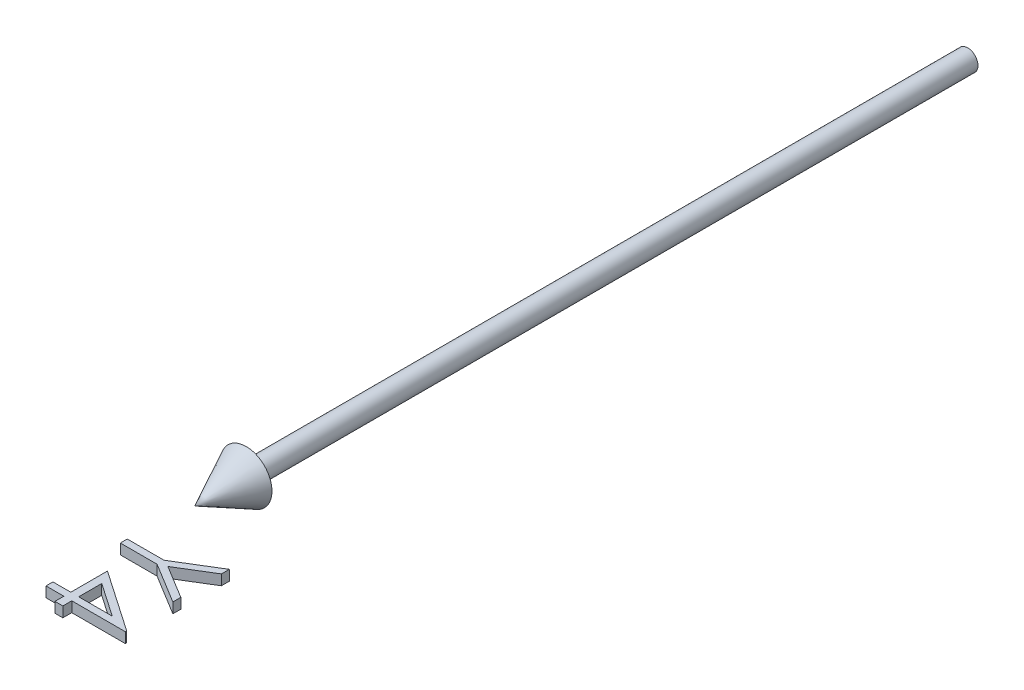
ISO-10303-21;
HEADER;
FILE_DESCRIPTION(('STEP AP214'),'2;1');
FILE_NAME('part.step','',(''),(''),'','','');
FILE_SCHEMA(('AUTOMOTIVE_DESIGN { 1 0 10303 214 1 1 1 1 }'));
ENDSEC;
DATA;
#1=APPLICATION_CONTEXT('core data for automotive mechanical design processes');
#2=APPLICATION_PROTOCOL_DEFINITION('international standard','automotive_design',2000,#1);
#3=PRODUCT_CONTEXT('',#1,'mechanical');
#4=PRODUCT('Part','Part','',(#3));
#5=PRODUCT_RELATED_PRODUCT_CATEGORY('part','',(#4));
#6=PRODUCT_DEFINITION_FORMATION('','',#4);
#7=PRODUCT_DEFINITION_CONTEXT('part definition',#1,'design');
#8=PRODUCT_DEFINITION('design','',#6,#7);
#9=PRODUCT_DEFINITION_SHAPE('','',#8);
#10=(LENGTH_UNIT() NAMED_UNIT(*) SI_UNIT(.MILLI.,.METRE.));
#11=(NAMED_UNIT(*) PLANE_ANGLE_UNIT() SI_UNIT($,.RADIAN.));
#12=(NAMED_UNIT(*) SI_UNIT($,.STERADIAN.) SOLID_ANGLE_UNIT());
#13=UNCERTAINTY_MEASURE_WITH_UNIT(LENGTH_MEASURE(1.E-05),#10,'distance_accuracy_value','');
#14=(GEOMETRIC_REPRESENTATION_CONTEXT(3) GLOBAL_UNCERTAINTY_ASSIGNED_CONTEXT((#13)) GLOBAL_UNIT_ASSIGNED_CONTEXT((#10,
#11,#12)) REPRESENTATION_CONTEXT('',''));
#15=CARTESIAN_POINT('',(0.,0.,0.));
#16=DIRECTION('',(0.,0.,1.));
#17=DIRECTION('',(1.,0.,0.));
#18=AXIS2_PLACEMENT_3D('',#15,#16,#17);
#19=CARTESIAN_POINT('',(0.,1.,0.));
#20=DIRECTION('',(0.,-1.,0.));
#21=DIRECTION('',(0.,0.,-1.));
#22=AXIS2_PLACEMENT_3D('',#19,#20,#21);
#23=PLANE('',#22);
#24=DIRECTION('',(0.824332768950697,0.,0.566105543193208));
#25=VECTOR('',#24,1.);
#26=CARTESIAN_POINT('',(3.46153846153846,1.,170.384615384615));
#27=LINE('',#26,#25);
#28=CARTESIAN_POINT('',(3.46153846153846,1.,170.384615384615));
#29=VERTEX_POINT('',#28);
#30=CARTESIAN_POINT('',(15.3846153846154,1.,178.572716346154));
#31=VERTEX_POINT('',#30);
#32=EDGE_CURVE('E153',#29,#31,#27,.T.);
#33=ORIENTED_EDGE('',*,*,#32,.F.);
#34=DIRECTION('',(0.,0.,-1.));
#35=VECTOR('',#34,1.);
#36=CARTESIAN_POINT('',(3.46153846153846,1.,177.5));
#37=LINE('',#36,#35);
#38=CARTESIAN_POINT('',(3.46153846153846,1.,177.5));
#39=VERTEX_POINT('',#38);
#40=EDGE_CURVE('E229',#39,#29,#37,.T.);
#41=ORIENTED_EDGE('',*,*,#40,.F.);
#42=DIRECTION('',(1.,0.,0.));
#43=VECTOR('',#42,1.);
#44=CARTESIAN_POINT('',(0.,1.,177.5));
#45=LINE('',#44,#43);
#46=CARTESIAN_POINT('',(0.,1.,177.5));
#47=VERTEX_POINT('',#46);
#48=EDGE_CURVE('E226',#47,#39,#45,.T.);
#49=ORIENTED_EDGE('',*,*,#48,.F.);
#50=DIRECTION('',(0.,0.,-1.));
#51=VECTOR('',#50,1.);
#52=CARTESIAN_POINT('',(0.,1.,178.846153846154));
#53=LINE('',#52,#51);
#54=CARTESIAN_POINT('',(0.,1.,178.846153846154));
#55=VERTEX_POINT('',#54);
#56=EDGE_CURVE('E223',#55,#47,#53,.T.);
#57=ORIENTED_EDGE('',*,*,#56,.F.);
#58=DIRECTION('',(-1.,0.,0.));
#59=VECTOR('',#58,1.);
#60=CARTESIAN_POINT('',(3.46153846153846,1.,178.846153846154));
#61=LINE('',#60,#59);
#62=CARTESIAN_POINT('',(3.46153846153846,1.,178.846153846154));
#63=VERTEX_POINT('',#62);
#64=EDGE_CURVE('E220',#63,#55,#61,.T.);
#65=ORIENTED_EDGE('',*,*,#64,.F.);
#66=DIRECTION('',(0.,0.,-1.));
#67=VECTOR('',#66,1.);
#68=CARTESIAN_POINT('',(3.46153846153846,1.,180.576923076923));
#69=LINE('',#68,#67);
#70=CARTESIAN_POINT('',(3.46153846153846,1.,180.576923076923));
#71=VERTEX_POINT('',#70);
#72=EDGE_CURVE('E217',#71,#63,#69,.T.);
#73=ORIENTED_EDGE('',*,*,#72,.F.);
#74=DIRECTION('',(-1.,0.,0.));
#75=VECTOR('',#74,1.);
#76=CARTESIAN_POINT('',(5.,1.,180.576923076923));
#77=LINE('',#76,#75);
#78=CARTESIAN_POINT('',(5.,1.,180.576923076923));
#79=VERTEX_POINT('',#78);
#80=EDGE_CURVE('E214',#79,#71,#77,.T.);
#81=ORIENTED_EDGE('',*,*,#80,.F.);
#82=DIRECTION('',(0.,0.,1.));
#83=VECTOR('',#82,1.);
#84=CARTESIAN_POINT('',(5.,1.,178.846153846154));
#85=LINE('',#84,#83);
#86=CARTESIAN_POINT('',(5.,1.,178.846153846154));
#87=VERTEX_POINT('',#86);
#88=EDGE_CURVE('E211',#87,#79,#85,.T.);
#89=ORIENTED_EDGE('',*,*,#88,.F.);
#90=DIRECTION('',(-1.,0.,0.));
#91=VECTOR('',#90,1.);
#92=CARTESIAN_POINT('',(15.3846153846154,1.,178.846153846154));
#93=LINE('',#92,#91);
#94=CARTESIAN_POINT('',(15.3846153846154,1.,178.846153846154));
#95=VERTEX_POINT('',#94);
#96=EDGE_CURVE('E208',#95,#87,#93,.T.);
#97=ORIENTED_EDGE('',*,*,#96,.F.);
#98=DIRECTION('',(0.,0.,1.));
#99=VECTOR('',#98,1.);
#100=CARTESIAN_POINT('',(15.3846153846154,1.,178.572716346154));
#101=LINE('',#100,#99);
#102=EDGE_CURVE('E205',#31,#95,#101,.T.);
#103=ORIENTED_EDGE('',*,*,#102,.F.);
#104=EDGE_LOOP('',(#33,#41,#49,#57,#65,#73,#81,#89,#97,#103));
#105=FACE_BOUND('',#104,.T.);
#106=DIRECTION('',(0.,0.,1.));
#107=VECTOR('',#106,1.);
#108=CARTESIAN_POINT('',(5.,1.,173.028846153846));
#109=LINE('',#108,#107);
#110=CARTESIAN_POINT('',(5.,1.,173.028846153846));
#111=VERTEX_POINT('',#110);
#112=CARTESIAN_POINT('',(5.,1.,177.5));
#113=VERTEX_POINT('',#112);
#114=EDGE_CURVE('E150',#111,#113,#109,.T.);
#115=ORIENTED_EDGE('',*,*,#114,.F.);
#116=DIRECTION('',(-0.82448552013318,0.,-0.565883050718714));
#117=VECTOR('',#116,1.);
#118=CARTESIAN_POINT('',(11.5144230769231,1.,177.5));
#119=LINE('',#118,#117);
#120=CARTESIAN_POINT('',(11.5144230769231,1.,177.5));
#121=VERTEX_POINT('',#120);
#122=EDGE_CURVE('E199',#121,#111,#119,.T.);
#123=ORIENTED_EDGE('',*,*,#122,.F.);
#124=DIRECTION('',(1.,0.,0.));
#125=VECTOR('',#124,1.);
#126=CARTESIAN_POINT('',(5.,1.,177.5));
#127=LINE('',#126,#125);
#128=EDGE_CURVE('E197',#113,#121,#127,.T.);
#129=ORIENTED_EDGE('',*,*,#128,.F.);
#130=EDGE_LOOP('',(#115,#123,#129));
#131=FACE_BOUND('',#130,.T.);
#132=ADVANCED_FACE('F46',(#105,#131),#23,.F.);
#133=CARTESIAN_POINT('',(3.46153846153846,1.,170.384615384615));
#134=DIRECTION('',(0.566105543193208,0.,-0.824332768950697));
#135=DIRECTION('',(-0.824332768950697,0.,-0.566105543193208));
#136=AXIS2_PLACEMENT_3D('',#133,#134,#135);
#137=PLANE('',#136);
#138=DIRECTION('',(0.,-1.,0.));
#139=VECTOR('',#138,1.);
#140=CARTESIAN_POINT('',(15.3846153846154,1.,178.572716346154));
#141=LINE('',#140,#139);
#142=CARTESIAN_POINT('',(15.3846153846154,-1.,178.572716346154));
#143=VERTEX_POINT('',#142);
#144=EDGE_CURVE('E50',#31,#143,#141,.T.);
#145=ORIENTED_EDGE('',*,*,#144,.T.);
#146=DIRECTION('',(0.824332768950697,0.,0.566105543193208));
#147=VECTOR('',#146,1.);
#148=CARTESIAN_POINT('',(3.46153846153846,-1.,170.384615384615));
#149=LINE('',#148,#147);
#150=CARTESIAN_POINT('',(3.46153846153846,-1.,170.384615384615));
#151=VERTEX_POINT('',#150);
#152=EDGE_CURVE('E166',#151,#143,#149,.T.);
#153=ORIENTED_EDGE('',*,*,#152,.F.);
#154=DIRECTION('',(0.,-1.,0.));
#155=VECTOR('',#154,1.);
#156=CARTESIAN_POINT('',(3.46153846153846,1.,170.384615384615));
#157=LINE('',#156,#155);
#158=EDGE_CURVE('E12',#29,#151,#157,.T.);
#159=ORIENTED_EDGE('',*,*,#158,.F.);
#160=ORIENTED_EDGE('',*,*,#32,.T.);
#161=EDGE_LOOP('',(#145,#153,#159,#160));
#162=FACE_BOUND('',#161,.T.);
#163=ADVANCED_FACE('F48',(#162),#137,.T.);
#164=CARTESIAN_POINT('',(3.46153846153846,1.,177.5));
#165=DIRECTION('',(-1.,0.,0.));
#166=DIRECTION('',(0.,0.,1.));
#167=AXIS2_PLACEMENT_3D('',#164,#165,#166);
#168=PLANE('',#167);
#169=ORIENTED_EDGE('',*,*,#158,.T.);
#170=DIRECTION('',(0.,0.,-1.));
#171=VECTOR('',#170,1.);
#172=CARTESIAN_POINT('',(3.46153846153846,-1.,177.5));
#173=LINE('',#172,#171);
#174=CARTESIAN_POINT('',(3.46153846153846,-1.,177.5));
#175=VERTEX_POINT('',#174);
#176=EDGE_CURVE('E193',#175,#151,#173,.T.);
#177=ORIENTED_EDGE('',*,*,#176,.F.);
#178=DIRECTION('',(0.,-1.,0.));
#179=VECTOR('',#178,1.);
#180=CARTESIAN_POINT('',(3.46153846153846,1.,177.5));
#181=LINE('',#180,#179);
#182=EDGE_CURVE('E55',#39,#175,#181,.T.);
#183=ORIENTED_EDGE('',*,*,#182,.F.);
#184=ORIENTED_EDGE('',*,*,#40,.T.);
#185=EDGE_LOOP('',(#169,#177,#183,#184));
#186=FACE_BOUND('',#185,.T.);
#187=ADVANCED_FACE('F253',(#186),#168,.T.);
#188=CARTESIAN_POINT('',(0.,1.,177.5));
#189=DIRECTION('',(0.,0.,-1.));
#190=DIRECTION('',(-1.,0.,0.));
#191=AXIS2_PLACEMENT_3D('',#188,#189,#190);
#192=PLANE('',#191);
#193=ORIENTED_EDGE('',*,*,#182,.T.);
#194=DIRECTION('',(1.,0.,0.));
#195=VECTOR('',#194,1.);
#196=CARTESIAN_POINT('',(0.,-1.,177.5));
#197=LINE('',#196,#195);
#198=CARTESIAN_POINT('',(0.,-1.,177.5));
#199=VERTEX_POINT('',#198);
#200=EDGE_CURVE('E190',#199,#175,#197,.T.);
#201=ORIENTED_EDGE('',*,*,#200,.F.);
#202=DIRECTION('',(0.,-1.,0.));
#203=VECTOR('',#202,1.);
#204=CARTESIAN_POINT('',(0.,1.,177.5));
#205=LINE('',#204,#203);
#206=EDGE_CURVE('E233',#47,#199,#205,.T.);
#207=ORIENTED_EDGE('',*,*,#206,.F.);
#208=ORIENTED_EDGE('',*,*,#48,.T.);
#209=EDGE_LOOP('',(#193,#201,#207,#208));
#210=FACE_BOUND('',#209,.T.);
#211=ADVANCED_FACE('F282',(#210),#192,.T.);
#212=CARTESIAN_POINT('',(0.,1.,178.846153846154));
#213=DIRECTION('',(-1.,0.,0.));
#214=DIRECTION('',(0.,0.,1.));
#215=AXIS2_PLACEMENT_3D('',#212,#213,#214);
#216=PLANE('',#215);
#217=ORIENTED_EDGE('',*,*,#206,.T.);
#218=DIRECTION('',(0.,0.,-1.));
#219=VECTOR('',#218,1.);
#220=CARTESIAN_POINT('',(0.,-1.,178.846153846154));
#221=LINE('',#220,#219);
#222=CARTESIAN_POINT('',(0.,-1.,178.846153846154));
#223=VERTEX_POINT('',#222);
#224=EDGE_CURVE('E187',#223,#199,#221,.T.);
#225=ORIENTED_EDGE('',*,*,#224,.F.);
#226=DIRECTION('',(0.,-1.,0.));
#227=VECTOR('',#226,1.);
#228=CARTESIAN_POINT('',(0.,1.,178.846153846154));
#229=LINE('',#228,#227);
#230=EDGE_CURVE('E235',#55,#223,#229,.T.);
#231=ORIENTED_EDGE('',*,*,#230,.F.);
#232=ORIENTED_EDGE('',*,*,#56,.T.);
#233=EDGE_LOOP('',(#217,#225,#231,#232));
#234=FACE_BOUND('',#233,.T.);
#235=ADVANCED_FACE('F280',(#234),#216,.T.);
#236=CARTESIAN_POINT('',(3.46153846153846,1.,178.846153846154));
#237=DIRECTION('',(0.,0.,1.));
#238=DIRECTION('',(1.,0.,0.));
#239=AXIS2_PLACEMENT_3D('',#236,#237,#238);
#240=PLANE('',#239);
#241=ORIENTED_EDGE('',*,*,#230,.T.);
#242=DIRECTION('',(-1.,0.,0.));
#243=VECTOR('',#242,1.);
#244=CARTESIAN_POINT('',(3.46153846153846,-1.,178.846153846154));
#245=LINE('',#244,#243);
#246=CARTESIAN_POINT('',(3.46153846153846,-1.,178.846153846154));
#247=VERTEX_POINT('',#246);
#248=EDGE_CURVE('E184',#247,#223,#245,.T.);
#249=ORIENTED_EDGE('',*,*,#248,.F.);
#250=DIRECTION('',(0.,-1.,0.));
#251=VECTOR('',#250,1.);
#252=CARTESIAN_POINT('',(3.46153846153846,1.,178.846153846154));
#253=LINE('',#252,#251);
#254=EDGE_CURVE('E237',#63,#247,#253,.T.);
#255=ORIENTED_EDGE('',*,*,#254,.F.);
#256=ORIENTED_EDGE('',*,*,#64,.T.);
#257=EDGE_LOOP('',(#241,#249,#255,#256));
#258=FACE_BOUND('',#257,.T.);
#259=ADVANCED_FACE('F278',(#258),#240,.T.);
#260=CARTESIAN_POINT('',(3.46153846153846,1.,180.576923076923));
#261=DIRECTION('',(-1.,0.,0.));
#262=DIRECTION('',(0.,0.,1.));
#263=AXIS2_PLACEMENT_3D('',#260,#261,#262);
#264=PLANE('',#263);
#265=ORIENTED_EDGE('',*,*,#254,.T.);
#266=DIRECTION('',(0.,0.,-1.));
#267=VECTOR('',#266,1.);
#268=CARTESIAN_POINT('',(3.46153846153846,-1.,180.576923076923));
#269=LINE('',#268,#267);
#270=CARTESIAN_POINT('',(3.46153846153846,-1.,180.576923076923));
#271=VERTEX_POINT('',#270);
#272=EDGE_CURVE('E181',#271,#247,#269,.T.);
#273=ORIENTED_EDGE('',*,*,#272,.F.);
#274=DIRECTION('',(0.,-1.,0.));
#275=VECTOR('',#274,1.);
#276=CARTESIAN_POINT('',(3.46153846153846,1.,180.576923076923));
#277=LINE('',#276,#275);
#278=EDGE_CURVE('E239',#71,#271,#277,.T.);
#279=ORIENTED_EDGE('',*,*,#278,.F.);
#280=ORIENTED_EDGE('',*,*,#72,.T.);
#281=EDGE_LOOP('',(#265,#273,#279,#280));
#282=FACE_BOUND('',#281,.T.);
#283=ADVANCED_FACE('F273',(#282),#264,.T.);
#284=CARTESIAN_POINT('',(5.,1.,180.576923076923));
#285=DIRECTION('',(0.,0.,1.));
#286=DIRECTION('',(1.,0.,0.));
#287=AXIS2_PLACEMENT_3D('',#284,#285,#286);
#288=PLANE('',#287);
#289=ORIENTED_EDGE('',*,*,#278,.T.);
#290=DIRECTION('',(-1.,0.,0.));
#291=VECTOR('',#290,1.);
#292=CARTESIAN_POINT('',(5.,-1.,180.576923076923));
#293=LINE('',#292,#291);
#294=CARTESIAN_POINT('',(5.,-1.,180.576923076923));
#295=VERTEX_POINT('',#294);
#296=EDGE_CURVE('E178',#295,#271,#293,.T.);
#297=ORIENTED_EDGE('',*,*,#296,.F.);
#298=DIRECTION('',(0.,-1.,0.));
#299=VECTOR('',#298,1.);
#300=CARTESIAN_POINT('',(5.,1.,180.576923076923));
#301=LINE('',#300,#299);
#302=EDGE_CURVE('E241',#79,#295,#301,.T.);
#303=ORIENTED_EDGE('',*,*,#302,.F.);
#304=ORIENTED_EDGE('',*,*,#80,.T.);
#305=EDGE_LOOP('',(#289,#297,#303,#304));
#306=FACE_BOUND('',#305,.T.);
#307=ADVANCED_FACE('F269',(#306),#288,.T.);
#308=CARTESIAN_POINT('',(5.,1.,178.846153846154));
#309=DIRECTION('',(1.,0.,0.));
#310=DIRECTION('',(0.,0.,-1.));
#311=AXIS2_PLACEMENT_3D('',#308,#309,#310);
#312=PLANE('',#311);
#313=ORIENTED_EDGE('',*,*,#302,.T.);
#314=DIRECTION('',(0.,0.,1.));
#315=VECTOR('',#314,1.);
#316=CARTESIAN_POINT('',(5.,-1.,178.846153846154));
#317=LINE('',#316,#315);
#318=CARTESIAN_POINT('',(5.,-1.,178.846153846154));
#319=VERTEX_POINT('',#318);
#320=EDGE_CURVE('E175',#319,#295,#317,.T.);
#321=ORIENTED_EDGE('',*,*,#320,.F.);
#322=DIRECTION('',(0.,-1.,0.));
#323=VECTOR('',#322,1.);
#324=CARTESIAN_POINT('',(5.,1.,178.846153846154));
#325=LINE('',#324,#323);
#326=EDGE_CURVE('E243',#87,#319,#325,.T.);
#327=ORIENTED_EDGE('',*,*,#326,.F.);
#328=ORIENTED_EDGE('',*,*,#88,.T.);
#329=EDGE_LOOP('',(#313,#321,#327,#328));
#330=FACE_BOUND('',#329,.T.);
#331=ADVANCED_FACE('F267',(#330),#312,.T.);
#332=CARTESIAN_POINT('',(15.3846153846154,1.,178.846153846154));
#333=DIRECTION('',(0.,0.,1.));
#334=DIRECTION('',(1.,0.,0.));
#335=AXIS2_PLACEMENT_3D('',#332,#333,#334);
#336=PLANE('',#335);
#337=ORIENTED_EDGE('',*,*,#326,.T.);
#338=DIRECTION('',(-1.,0.,0.));
#339=VECTOR('',#338,1.);
#340=CARTESIAN_POINT('',(15.3846153846154,-1.,178.846153846154));
#341=LINE('',#340,#339);
#342=CARTESIAN_POINT('',(15.3846153846154,-1.,178.846153846154));
#343=VERTEX_POINT('',#342);
#344=EDGE_CURVE('E172',#343,#319,#341,.T.);
#345=ORIENTED_EDGE('',*,*,#344,.F.);
#346=DIRECTION('',(0.,-1.,0.));
#347=VECTOR('',#346,1.);
#348=CARTESIAN_POINT('',(15.3846153846154,1.,178.846153846154));
#349=LINE('',#348,#347);
#350=EDGE_CURVE('E244',#95,#343,#349,.T.);
#351=ORIENTED_EDGE('',*,*,#350,.F.);
#352=ORIENTED_EDGE('',*,*,#96,.T.);
#353=EDGE_LOOP('',(#337,#345,#351,#352));
#354=FACE_BOUND('',#353,.T.);
#355=ADVANCED_FACE('F263',(#354),#336,.T.);
#356=CARTESIAN_POINT('',(15.3846153846154,1.,178.572716346154));
#357=DIRECTION('',(1.,0.,0.));
#358=DIRECTION('',(0.,0.,-1.));
#359=AXIS2_PLACEMENT_3D('',#356,#357,#358);
#360=PLANE('',#359);
#361=ORIENTED_EDGE('',*,*,#350,.T.);
#362=DIRECTION('',(0.,0.,1.));
#363=VECTOR('',#362,1.);
#364=CARTESIAN_POINT('',(15.3846153846154,-1.,178.572716346154));
#365=LINE('',#364,#363);
#366=EDGE_CURVE('E169',#143,#343,#365,.T.);
#367=ORIENTED_EDGE('',*,*,#366,.F.);
#368=ORIENTED_EDGE('',*,*,#144,.F.);
#369=ORIENTED_EDGE('',*,*,#102,.T.);
#370=EDGE_LOOP('',(#361,#367,#368,#369));
#371=FACE_BOUND('',#370,.T.);
#372=ADVANCED_FACE('F248',(#371),#360,.T.);
#373=CARTESIAN_POINT('',(5.,1.,173.028846153846));
#374=DIRECTION('',(1.,0.,0.));
#375=DIRECTION('',(0.,0.,-1.));
#376=AXIS2_PLACEMENT_3D('',#373,#374,#375);
#377=PLANE('',#376);
#378=DIRECTION('',(0.,-1.,0.));
#379=VECTOR('',#378,1.);
#380=CARTESIAN_POINT('',(5.,1.,177.5));
#381=LINE('',#380,#379);
#382=CARTESIAN_POINT('',(5.,-1.,177.5));
#383=VERTEX_POINT('',#382);
#384=EDGE_CURVE('E142',#113,#383,#381,.T.);
#385=ORIENTED_EDGE('',*,*,#384,.T.);
#386=DIRECTION('',(0.,0.,1.));
#387=VECTOR('',#386,1.);
#388=CARTESIAN_POINT('',(5.,-1.,173.028846153846));
#389=LINE('',#388,#387);
#390=CARTESIAN_POINT('',(5.,-1.,173.028846153846));
#391=VERTEX_POINT('',#390);
#392=EDGE_CURVE('E147',#391,#383,#389,.T.);
#393=ORIENTED_EDGE('',*,*,#392,.F.);
#394=DIRECTION('',(0.,-1.,0.));
#395=VECTOR('',#394,1.);
#396=CARTESIAN_POINT('',(5.,1.,173.028846153846));
#397=LINE('',#396,#395);
#398=EDGE_CURVE('E201',#111,#391,#397,.T.);
#399=ORIENTED_EDGE('',*,*,#398,.F.);
#400=ORIENTED_EDGE('',*,*,#114,.T.);
#401=EDGE_LOOP('',(#385,#393,#399,#400));
#402=FACE_BOUND('',#401,.T.);
#403=ADVANCED_FACE('F144',(#402),#377,.T.);
#404=CARTESIAN_POINT('',(5.,1.,177.5));
#405=DIRECTION('',(0.,0.,-1.));
#406=DIRECTION('',(-1.,0.,0.));
#407=AXIS2_PLACEMENT_3D('',#404,#405,#406);
#408=PLANE('',#407);
#409=DIRECTION('',(0.,-1.,0.));
#410=VECTOR('',#409,1.);
#411=CARTESIAN_POINT('',(11.5144230769231,1.,177.5));
#412=LINE('',#411,#410);
#413=CARTESIAN_POINT('',(11.5144230769231,-1.,177.5));
#414=VERTEX_POINT('',#413);
#415=EDGE_CURVE('E63',#121,#414,#412,.T.);
#416=ORIENTED_EDGE('',*,*,#415,.T.);
#417=DIRECTION('',(1.,0.,0.));
#418=VECTOR('',#417,1.);
#419=CARTESIAN_POINT('',(5.,-1.,177.5));
#420=LINE('',#419,#418);
#421=EDGE_CURVE('E156',#383,#414,#420,.T.);
#422=ORIENTED_EDGE('',*,*,#421,.F.);
#423=ORIENTED_EDGE('',*,*,#384,.F.);
#424=ORIENTED_EDGE('',*,*,#128,.T.);
#425=EDGE_LOOP('',(#416,#422,#423,#424));
#426=FACE_BOUND('',#425,.T.);
#427=ADVANCED_FACE('F157',(#426),#408,.T.);
#428=CARTESIAN_POINT('',(11.5144230769231,1.,177.5));
#429=DIRECTION('',(-0.565883050718714,0.,0.82448552013318));
#430=DIRECTION('',(0.82448552013318,0.,0.565883050718714));
#431=AXIS2_PLACEMENT_3D('',#428,#429,#430);
#432=PLANE('',#431);
#433=ORIENTED_EDGE('',*,*,#398,.T.);
#434=DIRECTION('',(-0.82448552013318,0.,-0.565883050718714));
#435=VECTOR('',#434,1.);
#436=CARTESIAN_POINT('',(11.5144230769231,-1.,177.5));
#437=LINE('',#436,#435);
#438=EDGE_CURVE('E159',#414,#391,#437,.T.);
#439=ORIENTED_EDGE('',*,*,#438,.F.);
#440=ORIENTED_EDGE('',*,*,#415,.F.);
#441=ORIENTED_EDGE('',*,*,#122,.T.);
#442=EDGE_LOOP('',(#433,#439,#440,#441));
#443=FACE_BOUND('',#442,.T.);
#444=ADVANCED_FACE('F301',(#443),#432,.T.);
#445=CARTESIAN_POINT('',(0.,-1.,0.));
#446=DIRECTION('',(0.,-1.,0.));
#447=DIRECTION('',(0.,0.,-1.));
#448=AXIS2_PLACEMENT_3D('',#445,#446,#447);
#449=PLANE('',#448);
#450=ORIENTED_EDGE('',*,*,#392,.T.);
#451=ORIENTED_EDGE('',*,*,#421,.T.);
#452=ORIENTED_EDGE('',*,*,#438,.T.);
#453=EDGE_LOOP('',(#450,#451,#452));
#454=FACE_BOUND('',#453,.T.);
#455=ORIENTED_EDGE('',*,*,#152,.T.);
#456=ORIENTED_EDGE('',*,*,#366,.T.);
#457=ORIENTED_EDGE('',*,*,#344,.T.);
#458=ORIENTED_EDGE('',*,*,#320,.T.);
#459=ORIENTED_EDGE('',*,*,#296,.T.);
#460=ORIENTED_EDGE('',*,*,#272,.T.);
#461=ORIENTED_EDGE('',*,*,#248,.T.);
#462=ORIENTED_EDGE('',*,*,#224,.T.);
#463=ORIENTED_EDGE('',*,*,#200,.T.);
#464=ORIENTED_EDGE('',*,*,#176,.T.);
#465=EDGE_LOOP('',(#455,#456,#457,#458,#459,#460,#461,#462,#463,#464));
#466=FACE_BOUND('',#465,.T.);
#467=ADVANCED_FACE('F161',(#454,#466),#449,.T.);
#468=CLOSED_SHELL('',(#132,#163,#187,#211,#235,#259,#283,#307,#331,#355,#372,#403,#427,#444,#467));
#469=MANIFOLD_SOLID_BREP('B2',#468);
#470=CARTESIAN_POINT('',(7.13040865384615,1.,163.076923076923));
#471=DIRECTION('',(-0.521331386880885,0.,-0.853354313900652));
#472=DIRECTION('',(-0.853354313900652,0.,0.521331386880885));
#473=AXIS2_PLACEMENT_3D('',#470,#471,#472);
#474=PLANE('',#473);
#475=DIRECTION('',(0.,-1.,0.));
#476=VECTOR('',#475,1.);
#477=CARTESIAN_POINT('',(15.,1.,158.269230769231));
#478=LINE('',#477,#476);
#479=CARTESIAN_POINT('',(15.,1.,158.269230769231));
#480=VERTEX_POINT('',#479);
#481=CARTESIAN_POINT('',(15.,-1.,158.269230769231));
#482=VERTEX_POINT('',#481);
#483=EDGE_CURVE('E436',#480,#482,#478,.T.);
#484=ORIENTED_EDGE('',*,*,#483,.T.);
#485=DIRECTION('',(0.853354313900652,0.,-0.521331386880885));
#486=VECTOR('',#485,1.);
#487=CARTESIAN_POINT('',(7.13040865384615,-1.,163.076923076923));
#488=LINE('',#487,#486);
#489=CARTESIAN_POINT('',(7.13040865384615,-1.,163.076923076923));
#490=VERTEX_POINT('',#489);
#491=EDGE_CURVE('E503',#490,#482,#488,.T.);
#492=ORIENTED_EDGE('',*,*,#491,.F.);
#493=DIRECTION('',(0.,-1.,0.));
#494=VECTOR('',#493,1.);
#495=CARTESIAN_POINT('',(7.13040865384615,1.,163.076923076923));
#496=LINE('',#495,#494);
#497=CARTESIAN_POINT('',(7.13040865384615,1.,163.076923076923));
#498=VERTEX_POINT('',#497);
#499=EDGE_CURVE('E44',#498,#490,#496,.T.);
#500=ORIENTED_EDGE('',*,*,#499,.F.);
#501=DIRECTION('',(0.853354313900652,0.,-0.521331386880885));
#502=VECTOR('',#501,1.);
#503=CARTESIAN_POINT('',(7.13040865384615,1.,163.076923076923));
#504=LINE('',#503,#502);
#505=EDGE_CURVE('E504',#498,#480,#504,.T.);
#506=ORIENTED_EDGE('',*,*,#505,.T.);
#507=EDGE_LOOP('',(#484,#492,#500,#506));
#508=FACE_BOUND('',#507,.T.);
#509=ADVANCED_FACE('F433',(#508),#474,.T.);
#510=CARTESIAN_POINT('',(0.,1.,163.076923076923));
#511=DIRECTION('',(0.,0.,-1.));
#512=DIRECTION('',(-1.,0.,0.));
#513=AXIS2_PLACEMENT_3D('',#510,#511,#512);
#514=PLANE('',#513);
#515=ORIENTED_EDGE('',*,*,#499,.T.);
#516=DIRECTION('',(1.,0.,0.));
#517=VECTOR('',#516,1.);
#518=CARTESIAN_POINT('',(0.,-1.,163.076923076923));
#519=LINE('',#518,#517);
#520=CARTESIAN_POINT('',(0.,-1.,163.076923076923));
#521=VERTEX_POINT('',#520);
#522=EDGE_CURVE('E521',#521,#490,#519,.T.);
#523=ORIENTED_EDGE('',*,*,#522,.F.);
#524=DIRECTION('',(0.,-1.,0.));
#525=VECTOR('',#524,1.);
#526=CARTESIAN_POINT('',(0.,1.,163.076923076923));
#527=LINE('',#526,#525);
#528=CARTESIAN_POINT('',(0.,1.,163.076923076923));
#529=VERTEX_POINT('',#528);
#530=EDGE_CURVE('E441',#529,#521,#527,.T.);
#531=ORIENTED_EDGE('',*,*,#530,.F.);
#532=DIRECTION('',(1.,0.,0.));
#533=VECTOR('',#532,1.);
#534=CARTESIAN_POINT('',(0.,1.,163.076923076923));
#535=LINE('',#534,#533);
#536=EDGE_CURVE('E509',#529,#498,#535,.T.);
#537=ORIENTED_EDGE('',*,*,#536,.T.);
#538=EDGE_LOOP('',(#515,#523,#531,#537));
#539=FACE_BOUND('',#538,.T.);
#540=ADVANCED_FACE('F597',(#539),#514,.T.);
#541=CARTESIAN_POINT('',(0.,1.,164.423076923077));
#542=DIRECTION('',(-1.,0.,0.));
#543=DIRECTION('',(0.,0.,1.));
#544=AXIS2_PLACEMENT_3D('',#541,#542,#543);
#545=PLANE('',#544);
#546=ORIENTED_EDGE('',*,*,#530,.T.);
#547=DIRECTION('',(0.,0.,-1.));
#548=VECTOR('',#547,1.);
#549=CARTESIAN_POINT('',(0.,-1.,164.423076923077));
#550=LINE('',#549,#548);
#551=CARTESIAN_POINT('',(0.,-1.,164.423076923077));
#552=VERTEX_POINT('',#551);
#553=EDGE_CURVE('E537',#552,#521,#550,.T.);
#554=ORIENTED_EDGE('',*,*,#553,.F.);
#555=DIRECTION('',(0.,-1.,0.));
#556=VECTOR('',#555,1.);
#557=CARTESIAN_POINT('',(0.,1.,164.423076923077));
#558=LINE('',#557,#556);
#559=CARTESIAN_POINT('',(0.,1.,164.423076923077));
#560=VERTEX_POINT('',#559);
#561=EDGE_CURVE('E562',#560,#552,#558,.T.);
#562=ORIENTED_EDGE('',*,*,#561,.F.);
#563=DIRECTION('',(0.,0.,-1.));
#564=VECTOR('',#563,1.);
#565=CARTESIAN_POINT('',(0.,1.,164.423076923077));
#566=LINE('',#565,#564);
#567=EDGE_CURVE('E558',#560,#529,#566,.T.);
#568=ORIENTED_EDGE('',*,*,#567,.T.);
#569=EDGE_LOOP('',(#546,#554,#562,#568));
#570=FACE_BOUND('',#569,.T.);
#571=ADVANCED_FACE('F595',(#570),#545,.T.);
#572=CARTESIAN_POINT('',(7.13040865384615,1.,164.423076923077));
#573=DIRECTION('',(0.,0.,1.));
#574=DIRECTION('',(1.,0.,0.));
#575=AXIS2_PLACEMENT_3D('',#572,#573,#574);
#576=PLANE('',#575);
#577=ORIENTED_EDGE('',*,*,#561,.T.);
#578=DIRECTION('',(-1.,0.,0.));
#579=VECTOR('',#578,1.);
#580=CARTESIAN_POINT('',(7.13040865384615,-1.,164.423076923077));
#581=LINE('',#580,#579);
#582=CARTESIAN_POINT('',(7.13040865384615,-1.,164.423076923077));
#583=VERTEX_POINT('',#582);
#584=EDGE_CURVE('E534',#583,#552,#581,.T.);
#585=ORIENTED_EDGE('',*,*,#584,.F.);
#586=DIRECTION('',(0.,-1.,0.));
#587=VECTOR('',#586,1.);
#588=CARTESIAN_POINT('',(7.13040865384615,1.,164.423076923077));
#589=LINE('',#588,#587);
#590=CARTESIAN_POINT('',(7.13040865384615,1.,164.423076923077));
#591=VERTEX_POINT('',#590);
#592=EDGE_CURVE('E564',#591,#583,#589,.T.);
#593=ORIENTED_EDGE('',*,*,#592,.F.);
#594=DIRECTION('',(-1.,0.,0.));
#595=VECTOR('',#594,1.);
#596=CARTESIAN_POINT('',(7.13040865384615,1.,164.423076923077));
#597=LINE('',#596,#595);
#598=EDGE_CURVE('E555',#591,#560,#597,.T.);
#599=ORIENTED_EDGE('',*,*,#598,.T.);
#600=EDGE_LOOP('',(#577,#585,#593,#599));
#601=FACE_BOUND('',#600,.T.);
#602=ADVANCED_FACE('F593',(#601),#576,.T.);
#603=CARTESIAN_POINT('',(15.,1.,169.230769230769));
#604=DIRECTION('',(-0.521331386880888,0.,0.853354313900651));
#605=DIRECTION('',(0.853354313900651,0.,0.521331386880888));
#606=AXIS2_PLACEMENT_3D('',#603,#604,#605);
#607=PLANE('',#606);
#608=ORIENTED_EDGE('',*,*,#592,.T.);
#609=DIRECTION('',(-0.853354313900651,0.,-0.521331386880888));
#610=VECTOR('',#609,1.);
#611=CARTESIAN_POINT('',(15.,-1.,169.230769230769));
#612=LINE('',#611,#610);
#613=CARTESIAN_POINT('',(15.,-1.,169.230769230769));
#614=VERTEX_POINT('',#613);
#615=EDGE_CURVE('E531',#614,#583,#612,.T.);
#616=ORIENTED_EDGE('',*,*,#615,.F.);
#617=DIRECTION('',(0.,-1.,0.));
#618=VECTOR('',#617,1.);
#619=CARTESIAN_POINT('',(15.,1.,169.230769230769));
#620=LINE('',#619,#618);
#621=CARTESIAN_POINT('',(15.,1.,169.230769230769));
#622=VERTEX_POINT('',#621);
#623=EDGE_CURVE('E566',#622,#614,#620,.T.);
#624=ORIENTED_EDGE('',*,*,#623,.F.);
#625=DIRECTION('',(-0.853354313900651,0.,-0.521331386880888));
#626=VECTOR('',#625,1.);
#627=CARTESIAN_POINT('',(15.,1.,169.230769230769));
#628=LINE('',#627,#626);
#629=EDGE_CURVE('E552',#622,#591,#628,.T.);
#630=ORIENTED_EDGE('',*,*,#629,.T.);
#631=EDGE_LOOP('',(#608,#616,#624,#630));
#632=FACE_BOUND('',#631,.T.);
#633=ADVANCED_FACE('F588',(#632),#607,.T.);
#634=CARTESIAN_POINT('',(15.,1.,167.689302884615));
#635=DIRECTION('',(1.,0.,0.));
#636=DIRECTION('',(0.,0.,-1.));
#637=AXIS2_PLACEMENT_3D('',#634,#635,#636);
#638=PLANE('',#637);
#639=ORIENTED_EDGE('',*,*,#623,.T.);
#640=DIRECTION('',(0.,0.,1.));
#641=VECTOR('',#640,1.);
#642=CARTESIAN_POINT('',(15.,-1.,167.689302884615));
#643=LINE('',#642,#641);
#644=CARTESIAN_POINT('',(15.,-1.,167.689302884615));
#645=VERTEX_POINT('',#644);
#646=EDGE_CURVE('E528',#645,#614,#643,.T.);
#647=ORIENTED_EDGE('',*,*,#646,.F.);
#648=DIRECTION('',(0.,-1.,0.));
#649=VECTOR('',#648,1.);
#650=CARTESIAN_POINT('',(15.,1.,167.689302884615));
#651=LINE('',#650,#649);
#652=CARTESIAN_POINT('',(15.,1.,167.689302884615));
#653=VERTEX_POINT('',#652);
#654=EDGE_CURVE('E568',#653,#645,#651,.T.);
#655=ORIENTED_EDGE('',*,*,#654,.F.);
#656=DIRECTION('',(0.,0.,1.));
#657=VECTOR('',#656,1.);
#658=CARTESIAN_POINT('',(15.,1.,167.689302884615));
#659=LINE('',#658,#657);
#660=EDGE_CURVE('E549',#653,#622,#659,.T.);
#661=ORIENTED_EDGE('',*,*,#660,.T.);
#662=EDGE_LOOP('',(#639,#647,#655,#661));
#663=FACE_BOUND('',#662,.T.);
#664=ADVANCED_FACE('F581',(#663),#638,.T.);
#665=CARTESIAN_POINT('',(8.5546875,1.,163.753004807692));
#666=DIRECTION('',(0.52120858483258,0.,-0.853429324019757));
#667=DIRECTION('',(-0.853429324019757,0.,-0.52120858483258));
#668=AXIS2_PLACEMENT_3D('',#665,#666,#667);
#669=PLANE('',#668);
#670=ORIENTED_EDGE('',*,*,#654,.T.);
#671=DIRECTION('',(0.853429324019757,0.,0.52120858483258));
#672=VECTOR('',#671,1.);
#673=CARTESIAN_POINT('',(8.5546875,-1.,163.753004807692));
#674=LINE('',#673,#672);
#675=CARTESIAN_POINT('',(8.5546875,-1.,163.753004807692));
#676=VERTEX_POINT('',#675);
#677=EDGE_CURVE('E525',#676,#645,#674,.T.);
#678=ORIENTED_EDGE('',*,*,#677,.F.);
#679=DIRECTION('',(0.,-1.,0.));
#680=VECTOR('',#679,1.);
#681=CARTESIAN_POINT('',(8.5546875,1.,163.753004807692));
#682=LINE('',#681,#680);
#683=CARTESIAN_POINT('',(8.5546875,1.,163.753004807692));
#684=VERTEX_POINT('',#683);
#685=EDGE_CURVE('E570',#684,#676,#682,.T.);
#686=ORIENTED_EDGE('',*,*,#685,.F.);
#687=DIRECTION('',(0.853429324019757,0.,0.52120858483258));
#688=VECTOR('',#687,1.);
#689=CARTESIAN_POINT('',(8.5546875,1.,163.753004807692));
#690=LINE('',#689,#688);
#691=EDGE_CURVE('E546',#684,#653,#690,.T.);
#692=ORIENTED_EDGE('',*,*,#691,.T.);
#693=EDGE_LOOP('',(#670,#678,#686,#692));
#694=FACE_BOUND('',#693,.T.);
#695=ADVANCED_FACE('F578',(#694),#669,.T.);
#696=CARTESIAN_POINT('',(15.,1.,159.810697115385));
#697=DIRECTION('',(0.521787793651244,0.,0.853075318126463));
#698=DIRECTION('',(0.853075318126463,0.,-0.521787793651244));
#699=AXIS2_PLACEMENT_3D('',#696,#697,#698);
#700=PLANE('',#699);
#701=ORIENTED_EDGE('',*,*,#685,.T.);
#702=DIRECTION('',(-0.853075318126463,0.,0.521787793651244));
#703=VECTOR('',#702,1.);
#704=CARTESIAN_POINT('',(15.,-1.,159.810697115385));
#705=LINE('',#704,#703);
#706=CARTESIAN_POINT('',(15.,-1.,159.810697115385));
#707=VERTEX_POINT('',#706);
#708=EDGE_CURVE('E516',#707,#676,#705,.T.);
#709=ORIENTED_EDGE('',*,*,#708,.F.);
#710=DIRECTION('',(0.,-1.,0.));
#711=VECTOR('',#710,1.);
#712=CARTESIAN_POINT('',(15.,1.,159.810697115385));
#713=LINE('',#712,#711);
#714=CARTESIAN_POINT('',(15.,1.,159.810697115385));
#715=VERTEX_POINT('',#714);
#716=EDGE_CURVE('E508',#715,#707,#713,.T.);
#717=ORIENTED_EDGE('',*,*,#716,.F.);
#718=DIRECTION('',(-0.853075318126463,0.,0.521787793651244));
#719=VECTOR('',#718,1.);
#720=CARTESIAN_POINT('',(15.,1.,159.810697115385));
#721=LINE('',#720,#719);
#722=EDGE_CURVE('E543',#715,#684,#721,.T.);
#723=ORIENTED_EDGE('',*,*,#722,.T.);
#724=EDGE_LOOP('',(#701,#709,#717,#723));
#725=FACE_BOUND('',#724,.T.);
#726=ADVANCED_FACE('F572',(#725),#700,.T.);
#727=CARTESIAN_POINT('',(15.,1.,158.269230769231));
#728=DIRECTION('',(1.,0.,0.));
#729=DIRECTION('',(0.,0.,-1.));
#730=AXIS2_PLACEMENT_3D('',#727,#728,#729);
#731=PLANE('',#730);
#732=ORIENTED_EDGE('',*,*,#716,.T.);
#733=DIRECTION('',(0.,0.,1.));
#734=VECTOR('',#733,1.);
#735=CARTESIAN_POINT('',(15.,-1.,158.269230769231));
#736=LINE('',#735,#734);
#737=EDGE_CURVE('E511',#482,#707,#736,.T.);
#738=ORIENTED_EDGE('',*,*,#737,.F.);
#739=ORIENTED_EDGE('',*,*,#483,.F.);
#740=DIRECTION('',(0.,0.,1.));
#741=VECTOR('',#740,1.);
#742=CARTESIAN_POINT('',(15.,1.,158.269230769231));
#743=LINE('',#742,#741);
#744=EDGE_CURVE('E541',#480,#715,#743,.T.);
#745=ORIENTED_EDGE('',*,*,#744,.T.);
#746=EDGE_LOOP('',(#732,#738,#739,#745));
#747=FACE_BOUND('',#746,.T.);
#748=ADVANCED_FACE('F512',(#747),#731,.T.);
#749=CARTESIAN_POINT('',(0.,1.,0.));
#750=DIRECTION('',(0.,1.,0.));
#751=DIRECTION('',(0.,0.,1.));
#752=AXIS2_PLACEMENT_3D('',#749,#750,#751);
#753=PLANE('',#752);
#754=ORIENTED_EDGE('',*,*,#505,.F.);
#755=ORIENTED_EDGE('',*,*,#536,.F.);
#756=ORIENTED_EDGE('',*,*,#567,.F.);
#757=ORIENTED_EDGE('',*,*,#598,.F.);
#758=ORIENTED_EDGE('',*,*,#629,.F.);
#759=ORIENTED_EDGE('',*,*,#660,.F.);
#760=ORIENTED_EDGE('',*,*,#691,.F.);
#761=ORIENTED_EDGE('',*,*,#722,.F.);
#762=ORIENTED_EDGE('',*,*,#744,.F.);
#763=EDGE_LOOP('',(#754,#755,#756,#757,#758,#759,#760,#761,#762));
#764=FACE_BOUND('',#763,.T.);
#765=ADVANCED_FACE('F584',(#764),#753,.T.);
#766=CARTESIAN_POINT('',(0.,-1.,0.));
#767=DIRECTION('',(0.,1.,0.));
#768=DIRECTION('',(0.,0.,1.));
#769=AXIS2_PLACEMENT_3D('',#766,#767,#768);
#770=PLANE('',#769);
#771=ORIENTED_EDGE('',*,*,#491,.T.);
#772=ORIENTED_EDGE('',*,*,#737,.T.);
#773=ORIENTED_EDGE('',*,*,#708,.T.);
#774=ORIENTED_EDGE('',*,*,#677,.T.);
#775=ORIENTED_EDGE('',*,*,#646,.T.);
#776=ORIENTED_EDGE('',*,*,#615,.T.);
#777=ORIENTED_EDGE('',*,*,#584,.T.);
#778=ORIENTED_EDGE('',*,*,#553,.T.);
#779=ORIENTED_EDGE('',*,*,#522,.T.);
#780=EDGE_LOOP('',(#771,#772,#773,#774,#775,#776,#777,#778,#779));
#781=FACE_BOUND('',#780,.T.);
#782=ADVANCED_FACE('F519',(#781),#770,.F.);
#783=CLOSED_SHELL('',(#509,#540,#571,#602,#633,#664,#695,#726,#748,#765,#782));
#784=MANIFOLD_SOLID_BREP('B6',#783);
#785=CARTESIAN_POINT('',(2.,0.,0.));
#786=DIRECTION('',(0.,0.,1.));
#787=DIRECTION('',(1.,0.,0.));
#788=AXIS2_PLACEMENT_3D('',#785,#786,#787);
#789=PLANE('',#788);
#790=CARTESIAN_POINT('',(0.,0.,0.));
#791=DIRECTION('',(0.,0.,-1.));
#792=DIRECTION('',(-1.,0.,0.));
#793=AXIS2_PLACEMENT_3D('',#790,#791,#792);
#794=CIRCLE('',#793,2.);
#795=CARTESIAN_POINT('',(-2.,0.,0.));
#796=VERTEX_POINT('',#795);
#797=EDGE_CURVE('E431',#796,#796,#794,.T.);
#798=ORIENTED_EDGE('',*,*,#797,.T.);
#799=EDGE_LOOP('',(#798));
#800=FACE_BOUND('',#799,.T.);
#801=ADVANCED_FACE('F687',(#800),#789,.F.);
#802=CARTESIAN_POINT('',(0.,0.,-41.9499520246458));
#803=DIRECTION('',(0.,0.,-1.));
#804=DIRECTION('',(-1.,0.,0.));
#805=AXIS2_PLACEMENT_3D('',#802,#803,#804);
#806=CYLINDRICAL_SURFACE('',#805,2.);
#807=ORIENTED_EDGE('',*,*,#797,.F.);
#808=EDGE_LOOP('',(#807));
#809=FACE_BOUND('',#808,.T.);
#810=CARTESIAN_POINT('',(0.,0.,140.));
#811=DIRECTION('',(0.,0.,-1.));
#812=DIRECTION('',(-1.,0.,0.));
#813=AXIS2_PLACEMENT_3D('',#810,#811,#812);
#814=CIRCLE('',#813,2.);
#815=CARTESIAN_POINT('',(-2.,0.,140.));
#816=VERTEX_POINT('',#815);
#817=EDGE_CURVE('E693',#816,#816,#814,.T.);
#818=ORIENTED_EDGE('',*,*,#817,.T.);
#819=EDGE_LOOP('',(#818));
#820=FACE_BOUND('',#819,.T.);
#821=ADVANCED_FACE('F704',(#809,#820),#806,.T.);
#822=CARTESIAN_POINT('',(5.00000000000002,0.,140.));
#823=DIRECTION('',(0.,0.,1.));
#824=DIRECTION('',(1.,0.,0.));
#825=AXIS2_PLACEMENT_3D('',#822,#823,#824);
#826=PLANE('',#825);
#827=ORIENTED_EDGE('',*,*,#817,.F.);
#828=EDGE_LOOP('',(#827));
#829=FACE_BOUND('',#828,.T.);
#830=CARTESIAN_POINT('',(0.,0.,140.));
#831=DIRECTION('',(0.,0.,-1.));
#832=DIRECTION('',(-1.,0.,0.));
#833=AXIS2_PLACEMENT_3D('',#830,#831,#832);
#834=CIRCLE('',#833,5.00000000000002);
#835=CARTESIAN_POINT('',(-5.00000000000002,0.,140.));
#836=VERTEX_POINT('',#835);
#837=EDGE_CURVE('E718',#836,#836,#834,.T.);
#838=ORIENTED_EDGE('',*,*,#837,.T.);
#839=EDGE_LOOP('',(#838));
#840=FACE_BOUND('',#839,.T.);
#841=ADVANCED_FACE('F698',(#829,#840),#826,.F.);
#842=CARTESIAN_POINT('',(0.,0.,150.));
#843=DIRECTION('',(0.,0.,-1.));
#844=DIRECTION('',(-1.,0.,0.));
#845=AXIS2_PLACEMENT_3D('',#842,#843,#844);
#846=CONICAL_SURFACE('',#845,0.,0.463647609000806);
#847=ORIENTED_EDGE('',*,*,#837,.F.);
#848=EDGE_LOOP('',(#847));
#849=FACE_BOUND('',#848,.T.);
#850=CARTESIAN_POINT('',(0.,0.,150.));
#851=VERTEX_POINT('',#850);
#852=VERTEX_LOOP('',#851);
#853=FACE_BOUND('',#852,.T.);
#854=ADVANCED_FACE('F696',(#849,#853),#846,.T.);
#855=CLOSED_SHELL('',(#801,#821,#841,#854));
#856=MANIFOLD_SOLID_BREP('B38',#855);
#857=ADVANCED_BREP_SHAPE_REPRESENTATION('',(#18,#469,#784,#856),#14);
#858=SHAPE_DEFINITION_REPRESENTATION(#9,#857);
ENDSEC;
END-ISO-10303-21;
